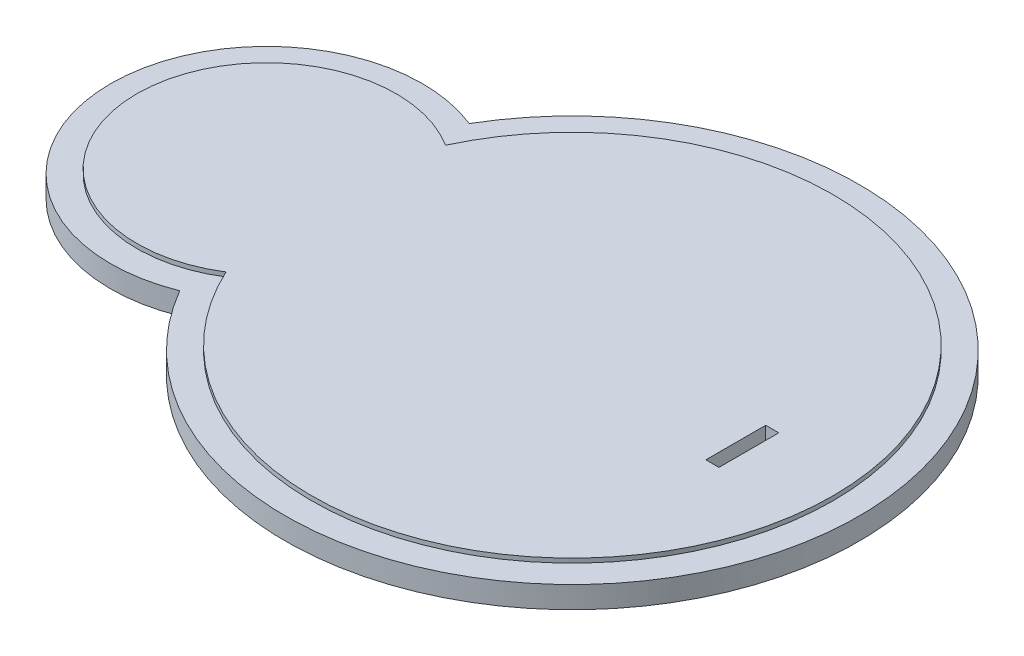
ISO-10303-21;
HEADER;
FILE_DESCRIPTION(('STEP AP214'),'2;1');
FILE_NAME('part.step','',(''),(''),'','','');
FILE_SCHEMA(('AUTOMOTIVE_DESIGN { 1 0 10303 214 1 1 1 1 }'));
ENDSEC;
DATA;
#1=APPLICATION_CONTEXT('core data for automotive mechanical design processes');
#2=APPLICATION_PROTOCOL_DEFINITION('international standard','automotive_design',2000,#1);
#3=PRODUCT_CONTEXT('',#1,'mechanical');
#4=PRODUCT('Part','Part','',(#3));
#5=PRODUCT_RELATED_PRODUCT_CATEGORY('part','',(#4));
#6=PRODUCT_DEFINITION_FORMATION('','',#4);
#7=PRODUCT_DEFINITION_CONTEXT('part definition',#1,'design');
#8=PRODUCT_DEFINITION('design','',#6,#7);
#9=PRODUCT_DEFINITION_SHAPE('','',#8);
#10=(LENGTH_UNIT() NAMED_UNIT(*) SI_UNIT(.MILLI.,.METRE.));
#11=(NAMED_UNIT(*) PLANE_ANGLE_UNIT() SI_UNIT($,.RADIAN.));
#12=(NAMED_UNIT(*) SI_UNIT($,.STERADIAN.) SOLID_ANGLE_UNIT());
#13=UNCERTAINTY_MEASURE_WITH_UNIT(LENGTH_MEASURE(1.E-05),#10,'distance_accuracy_value','');
#14=(GEOMETRIC_REPRESENTATION_CONTEXT(3) GLOBAL_UNCERTAINTY_ASSIGNED_CONTEXT((#13)) GLOBAL_UNIT_ASSIGNED_CONTEXT((#10,
#11,#12)) REPRESENTATION_CONTEXT('',''));
#15=CARTESIAN_POINT('',(0.,0.,0.));
#16=DIRECTION('',(0.,0.,1.));
#17=DIRECTION('',(1.,0.,0.));
#18=AXIS2_PLACEMENT_3D('',#15,#16,#17);
#19=CARTESIAN_POINT('',(-70.,6.,0.));
#20=DIRECTION('',(0.,-1.,0.));
#21=DIRECTION('',(0.,0.,-1.));
#22=AXIS2_PLACEMENT_3D('',#19,#20,#21);
#23=CYLINDRICAL_SURFACE('',#22,29.7);
#24=DIRECTION('',(0.,-1.,0.));
#25=VECTOR('',#24,1.);
#26=CARTESIAN_POINT('',(-54.1571428571428,6.,-25.1215819078143));
#27=LINE('',#26,#25);
#28=CARTESIAN_POINT('',(-54.1571428571428,6.,-25.1215819078143));
#29=VERTEX_POINT('',#28);
#30=CARTESIAN_POINT('',(-54.1571428571428,5.,-25.1215819078143));
#31=VERTEX_POINT('',#30);
#32=EDGE_CURVE('E47',#29,#31,#27,.T.);
#33=ORIENTED_EDGE('',*,*,#32,.T.);
#34=CARTESIAN_POINT('',(-70.,5.,0.));
#35=DIRECTION('',(0.,1.,0.));
#36=DIRECTION('',(0.,0.,1.));
#37=AXIS2_PLACEMENT_3D('',#34,#35,#36);
#38=CIRCLE('',#37,29.7);
#39=CARTESIAN_POINT('',(-54.1571428571429,5.,25.1215819078142));
#40=VERTEX_POINT('',#39);
#41=EDGE_CURVE('E147',#31,#40,#38,.T.);
#42=ORIENTED_EDGE('',*,*,#41,.T.);
#43=DIRECTION('',(0.,-1.,0.));
#44=VECTOR('',#43,1.);
#45=CARTESIAN_POINT('',(-54.1571428571429,6.,25.1215819078142));
#46=LINE('',#45,#44);
#47=CARTESIAN_POINT('',(-54.1571428571429,6.,25.1215819078142));
#48=VERTEX_POINT('',#47);
#49=EDGE_CURVE('E11',#48,#40,#46,.T.);
#50=ORIENTED_EDGE('',*,*,#49,.F.);
#51=CARTESIAN_POINT('',(-70.,6.,0.));
#52=DIRECTION('',(0.,1.,0.));
#53=DIRECTION('',(0.,0.,1.));
#54=AXIS2_PLACEMENT_3D('',#51,#52,#53);
#55=CIRCLE('',#54,29.7);
#56=EDGE_CURVE('E182',#29,#48,#55,.T.);
#57=ORIENTED_EDGE('',*,*,#56,.F.);
#58=EDGE_LOOP('',(#33,#42,#50,#57));
#59=FACE_BOUND('',#58,.T.);
#60=ADVANCED_FACE('F39',(#59),#23,.T.);
#61=CARTESIAN_POINT('',(0.,6.,0.));
#62=DIRECTION('',(0.,-1.,0.));
#63=DIRECTION('',(0.,0.,-1.));
#64=AXIS2_PLACEMENT_3D('',#61,#62,#63);
#65=CYLINDRICAL_SURFACE('',#64,59.7);
#66=ORIENTED_EDGE('',*,*,#49,.T.);
#67=CARTESIAN_POINT('',(0.,5.,0.));
#68=DIRECTION('',(0.,1.,0.));
#69=DIRECTION('',(0.,0.,1.));
#70=AXIS2_PLACEMENT_3D('',#67,#68,#69);
#71=CIRCLE('',#70,59.7);
#72=EDGE_CURVE('E156',#40,#31,#71,.T.);
#73=ORIENTED_EDGE('',*,*,#72,.T.);
#74=ORIENTED_EDGE('',*,*,#32,.F.);
#75=CARTESIAN_POINT('',(0.,6.,0.));
#76=DIRECTION('',(0.,1.,0.));
#77=DIRECTION('',(0.,0.,1.));
#78=AXIS2_PLACEMENT_3D('',#75,#76,#77);
#79=CIRCLE('',#78,59.7);
#80=EDGE_CURVE('E186',#48,#29,#79,.T.);
#81=ORIENTED_EDGE('',*,*,#80,.F.);
#82=EDGE_LOOP('',(#66,#73,#74,#81));
#83=FACE_BOUND('',#82,.T.);
#84=ADVANCED_FACE('F195',(#83),#65,.T.);
#85=CARTESIAN_POINT('',(-35.,6.,0.));
#86=DIRECTION('',(0.,1.,0.));
#87=DIRECTION('',(0.,0.,1.));
#88=AXIS2_PLACEMENT_3D('',#85,#86,#87);
#89=PLANE('',#88);
#90=DIRECTION('',(0.,0.,1.));
#91=VECTOR('',#90,1.);
#92=CARTESIAN_POINT('',(38.008087625214,6.,-6.25396856395946));
#93=LINE('',#92,#91);
#94=CARTESIAN_POINT('',(38.008087625214,6.,-6.25396856395946));
#95=VERTEX_POINT('',#94);
#96=CARTESIAN_POINT('',(38.008087625214,6.,7.44603143604053));
#97=VERTEX_POINT('',#96);
#98=EDGE_CURVE('E54',#95,#97,#93,.T.);
#99=ORIENTED_EDGE('',*,*,#98,.F.);
#100=DIRECTION('',(-1.,0.,0.));
#101=VECTOR('',#100,1.);
#102=CARTESIAN_POINT('',(38.008087625214,6.,-6.25396856395946));
#103=LINE('',#102,#101);
#104=CARTESIAN_POINT('',(41.008087625214,6.,-6.25396856395946));
#105=VERTEX_POINT('',#104);
#106=EDGE_CURVE('E125',#105,#95,#103,.T.);
#107=ORIENTED_EDGE('',*,*,#106,.F.);
#108=DIRECTION('',(0.,0.,-1.));
#109=VECTOR('',#108,1.);
#110=CARTESIAN_POINT('',(41.008087625214,6.,-6.25396856395946));
#111=LINE('',#110,#109);
#112=CARTESIAN_POINT('',(41.008087625214,6.,7.44603143604053));
#113=VERTEX_POINT('',#112);
#114=EDGE_CURVE('E129',#113,#105,#111,.T.);
#115=ORIENTED_EDGE('',*,*,#114,.F.);
#116=DIRECTION('',(1.,0.,0.));
#117=VECTOR('',#116,1.);
#118=CARTESIAN_POINT('',(38.008087625214,6.,7.44603143604053));
#119=LINE('',#118,#117);
#120=EDGE_CURVE('E138',#97,#113,#119,.T.);
#121=ORIENTED_EDGE('',*,*,#120,.F.);
#122=EDGE_LOOP('',(#99,#107,#115,#121));
#123=FACE_BOUND('',#122,.T.);
#124=ORIENTED_EDGE('',*,*,#56,.T.);
#125=ORIENTED_EDGE('',*,*,#80,.T.);
#126=EDGE_LOOP('',(#124,#125));
#127=FACE_BOUND('',#126,.T.);
#128=ADVANCED_FACE('F200',(#123,#127),#89,.T.);
#129=CARTESIAN_POINT('',(-35.,5.,0.));
#130=DIRECTION('',(0.,1.,0.));
#131=DIRECTION('',(0.,0.,1.));
#132=AXIS2_PLACEMENT_3D('',#129,#130,#131);
#133=PLANE('',#132);
#134=CARTESIAN_POINT('',(-70.,5.,0.));
#135=DIRECTION('',(0.,1.,0.));
#136=DIRECTION('',(0.,0.,1.));
#137=AXIS2_PLACEMENT_3D('',#134,#135,#136);
#138=CIRCLE('',#137,35.7);
#139=CARTESIAN_POINT('',(-56.7285714285714,5.,-33.1415024353675));
#140=VERTEX_POINT('',#139);
#141=CARTESIAN_POINT('',(-56.7285714285714,5.,33.1415024353675));
#142=VERTEX_POINT('',#141);
#143=EDGE_CURVE('E161',#140,#142,#138,.T.);
#144=ORIENTED_EDGE('',*,*,#143,.T.);
#145=CARTESIAN_POINT('',(0.,5.,0.));
#146=DIRECTION('',(0.,1.,0.));
#147=DIRECTION('',(0.,0.,1.));
#148=AXIS2_PLACEMENT_3D('',#145,#146,#147);
#149=CIRCLE('',#148,65.7);
#150=EDGE_CURVE('E165',#142,#140,#149,.T.);
#151=ORIENTED_EDGE('',*,*,#150,.T.);
#152=EDGE_LOOP('',(#144,#151));
#153=FACE_BOUND('',#152,.T.);
#154=ORIENTED_EDGE('',*,*,#72,.F.);
#155=ORIENTED_EDGE('',*,*,#41,.F.);
#156=EDGE_LOOP('',(#154,#155));
#157=FACE_BOUND('',#156,.T.);
#158=ADVANCED_FACE('F197',(#153,#157),#133,.T.);
#159=CARTESIAN_POINT('',(-70.,5.,0.));
#160=DIRECTION('',(0.,-1.,0.));
#161=DIRECTION('',(0.,0.,-1.));
#162=AXIS2_PLACEMENT_3D('',#159,#160,#161);
#163=CYLINDRICAL_SURFACE('',#162,35.7);
#164=CARTESIAN_POINT('',(-70.,0.,0.));
#165=DIRECTION('',(0.,1.,0.));
#166=DIRECTION('',(0.,0.,1.));
#167=AXIS2_PLACEMENT_3D('',#164,#165,#166);
#168=CIRCLE('',#167,35.7);
#169=CARTESIAN_POINT('',(-56.7285714285714,0.,-33.1415024353675));
#170=VERTEX_POINT('',#169);
#171=CARTESIAN_POINT('',(-56.7285714285714,0.,33.1415024353675));
#172=VERTEX_POINT('',#171);
#173=EDGE_CURVE('E160',#170,#172,#168,.T.);
#174=ORIENTED_EDGE('',*,*,#173,.T.);
#175=DIRECTION('',(0.,-1.,0.));
#176=VECTOR('',#175,1.);
#177=CARTESIAN_POINT('',(-56.7285714285714,5.,33.1415024353675));
#178=LINE('',#177,#176);
#179=EDGE_CURVE('E178',#142,#172,#178,.T.);
#180=ORIENTED_EDGE('',*,*,#179,.F.);
#181=ORIENTED_EDGE('',*,*,#143,.F.);
#182=DIRECTION('',(0.,-1.,0.));
#183=VECTOR('',#182,1.);
#184=CARTESIAN_POINT('',(-56.7285714285714,5.,-33.1415024353675));
#185=LINE('',#184,#183);
#186=EDGE_CURVE('E169',#140,#170,#185,.T.);
#187=ORIENTED_EDGE('',*,*,#186,.T.);
#188=EDGE_LOOP('',(#174,#180,#181,#187));
#189=FACE_BOUND('',#188,.T.);
#190=ADVANCED_FACE('F199',(#189),#163,.T.);
#191=CARTESIAN_POINT('',(0.,5.,0.));
#192=DIRECTION('',(0.,-1.,0.));
#193=DIRECTION('',(0.,0.,-1.));
#194=AXIS2_PLACEMENT_3D('',#191,#192,#193);
#195=CYLINDRICAL_SURFACE('',#194,65.7);
#196=CARTESIAN_POINT('',(0.,0.,0.));
#197=DIRECTION('',(0.,1.,0.));
#198=DIRECTION('',(0.,0.,1.));
#199=AXIS2_PLACEMENT_3D('',#196,#197,#198);
#200=CIRCLE('',#199,65.7);
#201=EDGE_CURVE('E166',#172,#170,#200,.T.);
#202=ORIENTED_EDGE('',*,*,#201,.T.);
#203=ORIENTED_EDGE('',*,*,#186,.F.);
#204=ORIENTED_EDGE('',*,*,#150,.F.);
#205=ORIENTED_EDGE('',*,*,#179,.T.);
#206=EDGE_LOOP('',(#202,#203,#204,#205));
#207=FACE_BOUND('',#206,.T.);
#208=ADVANCED_FACE('F207',(#207),#195,.T.);
#209=CARTESIAN_POINT('',(-35.,0.,0.));
#210=DIRECTION('',(0.,1.,0.));
#211=DIRECTION('',(0.,0.,1.));
#212=AXIS2_PLACEMENT_3D('',#209,#210,#211);
#213=PLANE('',#212);
#214=DIRECTION('',(-1.,0.,0.));
#215=VECTOR('',#214,1.);
#216=CARTESIAN_POINT('',(38.008087625214,0.,-6.25396856395946));
#217=LINE('',#216,#215);
#218=CARTESIAN_POINT('',(41.008087625214,0.,-6.25396856395946));
#219=VERTEX_POINT('',#218);
#220=CARTESIAN_POINT('',(38.008087625214,0.,-6.25396856395946));
#221=VERTEX_POINT('',#220);
#222=EDGE_CURVE('E113',#219,#221,#217,.T.);
#223=ORIENTED_EDGE('',*,*,#222,.T.);
#224=DIRECTION('',(0.,0.,1.));
#225=VECTOR('',#224,1.);
#226=CARTESIAN_POINT('',(38.008087625214,0.,-6.25396856395946));
#227=LINE('',#226,#225);
#228=CARTESIAN_POINT('',(38.008087625214,0.,7.44603143604053));
#229=VERTEX_POINT('',#228);
#230=EDGE_CURVE('E106',#221,#229,#227,.T.);
#231=ORIENTED_EDGE('',*,*,#230,.T.);
#232=DIRECTION('',(1.,0.,0.));
#233=VECTOR('',#232,1.);
#234=CARTESIAN_POINT('',(38.008087625214,0.,7.44603143604053));
#235=LINE('',#234,#233);
#236=CARTESIAN_POINT('',(41.008087625214,0.,7.44603143604053));
#237=VERTEX_POINT('',#236);
#238=EDGE_CURVE('E116',#229,#237,#235,.T.);
#239=ORIENTED_EDGE('',*,*,#238,.T.);
#240=DIRECTION('',(0.,0.,-1.));
#241=VECTOR('',#240,1.);
#242=CARTESIAN_POINT('',(41.008087625214,0.,-6.25396856395946));
#243=LINE('',#242,#241);
#244=EDGE_CURVE('E62',#237,#219,#243,.T.);
#245=ORIENTED_EDGE('',*,*,#244,.T.);
#246=EDGE_LOOP('',(#223,#231,#239,#245));
#247=FACE_BOUND('',#246,.T.);
#248=ORIENTED_EDGE('',*,*,#173,.F.);
#249=ORIENTED_EDGE('',*,*,#201,.F.);
#250=EDGE_LOOP('',(#248,#249));
#251=FACE_BOUND('',#250,.T.);
#252=ADVANCED_FACE('F121',(#247,#251),#213,.F.);
#253=CARTESIAN_POINT('',(38.008087625214,0.,-6.25396856395946));
#254=DIRECTION('',(-1.,0.,0.));
#255=DIRECTION('',(0.,0.,1.));
#256=AXIS2_PLACEMENT_3D('',#253,#254,#255);
#257=PLANE('',#256);
#258=ORIENTED_EDGE('',*,*,#98,.T.);
#259=DIRECTION('',(0.,1.,0.));
#260=VECTOR('',#259,1.);
#261=CARTESIAN_POINT('',(38.008087625214,0.,7.44603143604053));
#262=LINE('',#261,#260);
#263=EDGE_CURVE('E102',#229,#97,#262,.T.);
#264=ORIENTED_EDGE('',*,*,#263,.F.);
#265=ORIENTED_EDGE('',*,*,#230,.F.);
#266=DIRECTION('',(0.,1.,0.));
#267=VECTOR('',#266,1.);
#268=CARTESIAN_POINT('',(38.008087625214,0.,-6.25396856395946));
#269=LINE('',#268,#267);
#270=EDGE_CURVE('E144',#221,#95,#269,.T.);
#271=ORIENTED_EDGE('',*,*,#270,.T.);
#272=EDGE_LOOP('',(#258,#264,#265,#271));
#273=FACE_BOUND('',#272,.T.);
#274=ADVANCED_FACE('F104',(#273),#257,.F.);
#275=CARTESIAN_POINT('',(38.008087625214,0.,-6.25396856395946));
#276=DIRECTION('',(0.,0.,-1.));
#277=DIRECTION('',(-1.,0.,0.));
#278=AXIS2_PLACEMENT_3D('',#275,#276,#277);
#279=PLANE('',#278);
#280=ORIENTED_EDGE('',*,*,#106,.T.);
#281=ORIENTED_EDGE('',*,*,#270,.F.);
#282=ORIENTED_EDGE('',*,*,#222,.F.);
#283=DIRECTION('',(0.,1.,0.));
#284=VECTOR('',#283,1.);
#285=CARTESIAN_POINT('',(41.008087625214,0.,-6.25396856395946));
#286=LINE('',#285,#284);
#287=EDGE_CURVE('E148',#219,#105,#286,.T.);
#288=ORIENTED_EDGE('',*,*,#287,.T.);
#289=EDGE_LOOP('',(#280,#281,#282,#288));
#290=FACE_BOUND('',#289,.T.);
#291=ADVANCED_FACE('F243',(#290),#279,.F.);
#292=CARTESIAN_POINT('',(41.008087625214,0.,-6.25396856395946));
#293=DIRECTION('',(1.,0.,0.));
#294=DIRECTION('',(0.,0.,-1.));
#295=AXIS2_PLACEMENT_3D('',#292,#293,#294);
#296=PLANE('',#295);
#297=ORIENTED_EDGE('',*,*,#114,.T.);
#298=ORIENTED_EDGE('',*,*,#287,.F.);
#299=ORIENTED_EDGE('',*,*,#244,.F.);
#300=DIRECTION('',(0.,1.,0.));
#301=VECTOR('',#300,1.);
#302=CARTESIAN_POINT('',(41.008087625214,0.,7.44603143604053));
#303=LINE('',#302,#301);
#304=EDGE_CURVE('E112',#237,#113,#303,.T.);
#305=ORIENTED_EDGE('',*,*,#304,.T.);
#306=EDGE_LOOP('',(#297,#298,#299,#305));
#307=FACE_BOUND('',#306,.T.);
#308=ADVANCED_FACE('F249',(#307),#296,.F.);
#309=CARTESIAN_POINT('',(38.008087625214,0.,7.44603143604053));
#310=DIRECTION('',(0.,0.,1.));
#311=DIRECTION('',(1.,0.,0.));
#312=AXIS2_PLACEMENT_3D('',#309,#310,#311);
#313=PLANE('',#312);
#314=ORIENTED_EDGE('',*,*,#120,.T.);
#315=ORIENTED_EDGE('',*,*,#304,.F.);
#316=ORIENTED_EDGE('',*,*,#238,.F.);
#317=ORIENTED_EDGE('',*,*,#263,.T.);
#318=EDGE_LOOP('',(#314,#315,#316,#317));
#319=FACE_BOUND('',#318,.T.);
#320=ADVANCED_FACE('F117',(#319),#313,.F.);
#321=CLOSED_SHELL('',(#60,#84,#128,#158,#190,#208,#252,#274,#291,#308,#320));
#322=MANIFOLD_SOLID_BREP('B2',#321);
#323=ADVANCED_BREP_SHAPE_REPRESENTATION('',(#18,#322),#14);
#324=SHAPE_DEFINITION_REPRESENTATION(#9,#323);
ENDSEC;
END-ISO-10303-21;
